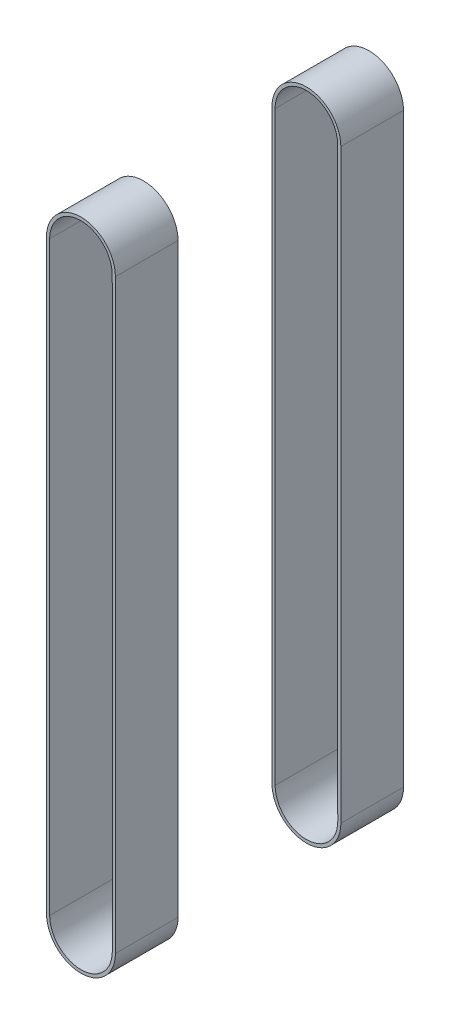
ISO-10303-21;
HEADER;
FILE_DESCRIPTION(('STEP AP214'),'2;1');
FILE_NAME('part.step','',(''),(''),'','','');
FILE_SCHEMA(('AUTOMOTIVE_DESIGN { 1 0 10303 214 1 1 1 1 }'));
ENDSEC;
DATA;
#1=APPLICATION_CONTEXT('core data for automotive mechanical design processes');
#2=APPLICATION_PROTOCOL_DEFINITION('international standard','automotive_design',2000,#1);
#3=PRODUCT_CONTEXT('',#1,'mechanical');
#4=PRODUCT('Part','Part','',(#3));
#5=PRODUCT_RELATED_PRODUCT_CATEGORY('part','',(#4));
#6=PRODUCT_DEFINITION_FORMATION('','',#4);
#7=PRODUCT_DEFINITION_CONTEXT('part definition',#1,'design');
#8=PRODUCT_DEFINITION('design','',#6,#7);
#9=PRODUCT_DEFINITION_SHAPE('','',#8);
#10=(LENGTH_UNIT() NAMED_UNIT(*) SI_UNIT(.MILLI.,.METRE.));
#11=(NAMED_UNIT(*) PLANE_ANGLE_UNIT() SI_UNIT($,.RADIAN.));
#12=(NAMED_UNIT(*) SI_UNIT($,.STERADIAN.) SOLID_ANGLE_UNIT());
#13=UNCERTAINTY_MEASURE_WITH_UNIT(LENGTH_MEASURE(1.E-05),#10,'distance_accuracy_value','');
#14=(GEOMETRIC_REPRESENTATION_CONTEXT(3) GLOBAL_UNCERTAINTY_ASSIGNED_CONTEXT((#13)) GLOBAL_UNIT_ASSIGNED_CONTEXT((#10,
#11,#12)) REPRESENTATION_CONTEXT('',''));
#15=CARTESIAN_POINT('',(0.,0.,0.));
#16=DIRECTION('',(0.,0.,1.));
#17=DIRECTION('',(1.,0.,0.));
#18=AXIS2_PLACEMENT_3D('',#15,#16,#17);
#19=CARTESIAN_POINT('',(291.582674493415,88.0786711003766,-29.21));
#20=DIRECTION('',(0.,0.,-1.));
#21=DIRECTION('',(1.,0.,0.));
#22=AXIS2_PLACEMENT_3D('',#19,#20,#21);
#23=PLANE('',#22);
#24=CARTESIAN_POINT('',(291.582674493415,88.0786711003766,-29.21));
#25=DIRECTION('',(0.,0.,1.));
#26=DIRECTION('',(1.,0.,0.));
#27=AXIS2_PLACEMENT_3D('',#24,#25,#26);
#28=CIRCLE('',#27,6.985);
#29=CARTESIAN_POINT('',(298.567674473504,88.0791985022353,-29.21));
#30=VERTEX_POINT('',#29);
#31=CARTESIAN_POINT('',(284.597674513326,88.0781436985179,-29.21));
#32=VERTEX_POINT('',#31);
#33=EDGE_CURVE('E144',#30,#32,#28,.T.);
#34=ORIENTED_EDGE('',*,*,#33,.F.);
#35=DIRECTION('',(-7.55049189264925E-05,0.999999997149504,0.));
#36=VECTOR('',#35,1.);
#37=CARTESIAN_POINT('',(298.567674473504,88.0791985022353,-29.21));
#38=LINE('',#37,#36);
#39=CARTESIAN_POINT('',(298.576648031743,-30.7681341055025,-29.21));
#40=VERTEX_POINT('',#39);
#41=EDGE_CURVE('E154',#40,#30,#38,.T.);
#42=ORIENTED_EDGE('',*,*,#41,.F.);
#43=CARTESIAN_POINT('',(291.591648051654,-30.7686615073612,-29.21));
#44=DIRECTION('',(0.,0.,1.));
#45=DIRECTION('',(1.,0.,0.));
#46=AXIS2_PLACEMENT_3D('',#43,#44,#45);
#47=CIRCLE('',#46,6.985);
#48=CARTESIAN_POINT('',(284.606648071565,-30.7691889092199,-29.21));
#49=VERTEX_POINT('',#48);
#50=EDGE_CURVE('E151',#49,#40,#47,.T.);
#51=ORIENTED_EDGE('',*,*,#50,.F.);
#52=DIRECTION('',(7.55049189264925E-05,-0.999999997149503,0.));
#53=VECTOR('',#52,1.);
#54=CARTESIAN_POINT('',(284.597674513326,88.0781436985179,-29.21));
#55=LINE('',#54,#53);
#56=EDGE_CURVE('E147',#32,#49,#55,.T.);
#57=ORIENTED_EDGE('',*,*,#56,.F.);
#58=EDGE_LOOP('',(#34,#42,#51,#57));
#59=FACE_BOUND('',#58,.T.);
#60=DIRECTION('',(7.55049189269596E-05,-0.999999997149503,0.));
#61=VECTOR('',#60,1.);
#62=CARTESIAN_POINT('',(285.232674511516,88.0781916441414,-29.21));
#63=LINE('',#62,#61);
#64=CARTESIAN_POINT('',(285.232674511516,88.0781916441414,-29.21));
#65=VERTEX_POINT('',#64);
#66=CARTESIAN_POINT('',(285.241648069755,-30.7691409635964,-29.21));
#67=VERTEX_POINT('',#66);
#68=EDGE_CURVE('E125',#65,#67,#63,.T.);
#69=ORIENTED_EDGE('',*,*,#68,.T.);
#70=CARTESIAN_POINT('',(291.591648051654,-30.7686615073612,-29.21));
#71=DIRECTION('',(0.,0.,1.));
#72=DIRECTION('',(1.,0.,0.));
#73=AXIS2_PLACEMENT_3D('',#70,#71,#72);
#74=CIRCLE('',#73,6.34999999999999);
#75=CARTESIAN_POINT('',(297.941648033553,-30.768182051126,-29.21));
#76=VERTEX_POINT('',#75);
#77=EDGE_CURVE('E130',#67,#76,#74,.T.);
#78=ORIENTED_EDGE('',*,*,#77,.T.);
#79=DIRECTION('',(-7.55049189269596E-05,0.999999997149504,0.));
#80=VECTOR('',#79,1.);
#81=CARTESIAN_POINT('',(297.932674475314,88.0791505566118,-29.21));
#82=LINE('',#81,#80);
#83=CARTESIAN_POINT('',(297.932674475314,88.0791505566118,-29.21));
#84=VERTEX_POINT('',#83);
#85=EDGE_CURVE('E126',#76,#84,#82,.T.);
#86=ORIENTED_EDGE('',*,*,#85,.T.);
#87=CARTESIAN_POINT('',(291.582674493415,88.0786711003766,-29.21));
#88=DIRECTION('',(0.,0.,1.));
#89=DIRECTION('',(1.,0.,0.));
#90=AXIS2_PLACEMENT_3D('',#87,#88,#89);
#91=CIRCLE('',#90,6.34999999999999);
#92=EDGE_CURVE('E111',#84,#65,#91,.T.);
#93=ORIENTED_EDGE('',*,*,#92,.T.);
#94=EDGE_LOOP('',(#69,#78,#86,#93));
#95=FACE_BOUND('',#94,.T.);
#96=ADVANCED_FACE('F45',(#59,#95),#23,.T.);
#97=CARTESIAN_POINT('',(291.582674493415,88.0786711003766,-16.51));
#98=DIRECTION('',(0.,0.,-1.));
#99=DIRECTION('',(1.,0.,0.));
#100=AXIS2_PLACEMENT_3D('',#97,#98,#99);
#101=PLANE('',#100);
#102=CARTESIAN_POINT('',(291.582674493415,88.0786711003766,-16.51));
#103=DIRECTION('',(0.,0.,1.));
#104=DIRECTION('',(1.,0.,0.));
#105=AXIS2_PLACEMENT_3D('',#102,#103,#104);
#106=CIRCLE('',#105,6.985);
#107=CARTESIAN_POINT('',(298.567674473504,88.0791985022353,-16.51));
#108=VERTEX_POINT('',#107);
#109=CARTESIAN_POINT('',(284.597674513326,88.0781436985179,-16.51));
#110=VERTEX_POINT('',#109);
#111=EDGE_CURVE('E119',#108,#110,#106,.T.);
#112=ORIENTED_EDGE('',*,*,#111,.T.);
#113=DIRECTION('',(7.55049189264925E-05,-0.999999997149503,0.));
#114=VECTOR('',#113,1.);
#115=CARTESIAN_POINT('',(284.597674513326,88.0781436985179,-16.51));
#116=LINE('',#115,#114);
#117=CARTESIAN_POINT('',(284.606648071565,-30.7691889092199,-16.51));
#118=VERTEX_POINT('',#117);
#119=EDGE_CURVE('E160',#110,#118,#116,.T.);
#120=ORIENTED_EDGE('',*,*,#119,.T.);
#121=CARTESIAN_POINT('',(291.591648051654,-30.7686615073612,-16.51));
#122=DIRECTION('',(0.,0.,1.));
#123=DIRECTION('',(1.,0.,0.));
#124=AXIS2_PLACEMENT_3D('',#121,#122,#123);
#125=CIRCLE('',#124,6.985);
#126=CARTESIAN_POINT('',(298.576648031743,-30.7681341055025,-16.51));
#127=VERTEX_POINT('',#126);
#128=EDGE_CURVE('E163',#118,#127,#125,.T.);
#129=ORIENTED_EDGE('',*,*,#128,.T.);
#130=DIRECTION('',(-7.55049189264925E-05,0.999999997149504,0.));
#131=VECTOR('',#130,1.);
#132=CARTESIAN_POINT('',(298.567674473504,88.0791985022353,-16.51));
#133=LINE('',#132,#131);
#134=EDGE_CURVE('E148',#127,#108,#133,.T.);
#135=ORIENTED_EDGE('',*,*,#134,.T.);
#136=EDGE_LOOP('',(#112,#120,#129,#135));
#137=FACE_BOUND('',#136,.T.);
#138=CARTESIAN_POINT('',(291.582674493415,88.0786711003766,-16.51));
#139=DIRECTION('',(0.,0.,1.));
#140=DIRECTION('',(1.,0.,0.));
#141=AXIS2_PLACEMENT_3D('',#138,#139,#140);
#142=CIRCLE('',#141,6.34999999999999);
#143=CARTESIAN_POINT('',(297.932674475314,88.0791505566118,-16.51));
#144=VERTEX_POINT('',#143);
#145=CARTESIAN_POINT('',(285.232674511516,88.0781916441414,-16.51));
#146=VERTEX_POINT('',#145);
#147=EDGE_CURVE('E114',#144,#146,#142,.T.);
#148=ORIENTED_EDGE('',*,*,#147,.F.);
#149=DIRECTION('',(-7.55049189269596E-05,0.999999997149504,0.));
#150=VECTOR('',#149,1.);
#151=CARTESIAN_POINT('',(297.932674475314,88.0791505566118,-16.51));
#152=LINE('',#151,#150);
#153=CARTESIAN_POINT('',(297.941648033553,-30.768182051126,-16.51));
#154=VERTEX_POINT('',#153);
#155=EDGE_CURVE('E127',#154,#144,#152,.T.);
#156=ORIENTED_EDGE('',*,*,#155,.F.);
#157=CARTESIAN_POINT('',(291.591648051654,-30.7686615073612,-16.51));
#158=DIRECTION('',(0.,0.,1.));
#159=DIRECTION('',(1.,0.,0.));
#160=AXIS2_PLACEMENT_3D('',#157,#158,#159);
#161=CIRCLE('',#160,6.34999999999999);
#162=CARTESIAN_POINT('',(285.241648069755,-30.7691409635964,-16.51));
#163=VERTEX_POINT('',#162);
#164=EDGE_CURVE('E138',#163,#154,#161,.T.);
#165=ORIENTED_EDGE('',*,*,#164,.F.);
#166=DIRECTION('',(7.55049189269596E-05,-0.999999997149503,0.));
#167=VECTOR('',#166,1.);
#168=CARTESIAN_POINT('',(285.232674511516,88.0781916441414,-16.51));
#169=LINE('',#168,#167);
#170=EDGE_CURVE('E136',#146,#163,#169,.T.);
#171=ORIENTED_EDGE('',*,*,#170,.F.);
#172=EDGE_LOOP('',(#148,#156,#165,#171));
#173=FACE_BOUND('',#172,.T.);
#174=ADVANCED_FACE('F180',(#137,#173),#101,.F.);
#175=CARTESIAN_POINT('',(291.582674493415,88.0786711003766,-29.21));
#176=DIRECTION('',(0.,0.,1.));
#177=DIRECTION('',(-1.,0.,0.));
#178=AXIS2_PLACEMENT_3D('',#175,#176,#177);
#179=CYLINDRICAL_SURFACE('',#178,6.985);
#180=ORIENTED_EDGE('',*,*,#111,.F.);
#181=DIRECTION('',(0.,0.,1.));
#182=VECTOR('',#181,1.);
#183=CARTESIAN_POINT('',(298.567674473504,88.0791985022353,-29.21));
#184=LINE('',#183,#182);
#185=EDGE_CURVE('E157',#30,#108,#184,.T.);
#186=ORIENTED_EDGE('',*,*,#185,.F.);
#187=ORIENTED_EDGE('',*,*,#33,.T.);
#188=DIRECTION('',(0.,0.,1.));
#189=VECTOR('',#188,1.);
#190=CARTESIAN_POINT('',(284.597674513326,88.0781436985179,-29.21));
#191=LINE('',#190,#189);
#192=EDGE_CURVE('E12',#32,#110,#191,.T.);
#193=ORIENTED_EDGE('',*,*,#192,.T.);
#194=EDGE_LOOP('',(#180,#186,#187,#193));
#195=FACE_BOUND('',#194,.T.);
#196=ADVANCED_FACE('F47',(#195),#179,.T.);
#197=CARTESIAN_POINT('',(284.597674513326,88.0781436985179,-29.21));
#198=DIRECTION('',(0.999999997149503,7.55049189264925E-05,0.));
#199=DIRECTION('',(-7.55049189264925E-05,0.999999997149504,0.));
#200=AXIS2_PLACEMENT_3D('',#197,#198,#199);
#201=PLANE('',#200);
#202=ORIENTED_EDGE('',*,*,#119,.F.);
#203=ORIENTED_EDGE('',*,*,#192,.F.);
#204=ORIENTED_EDGE('',*,*,#56,.T.);
#205=DIRECTION('',(0.,0.,1.));
#206=VECTOR('',#205,1.);
#207=CARTESIAN_POINT('',(284.606648071565,-30.7691889092199,-29.21));
#208=LINE('',#207,#206);
#209=EDGE_CURVE('E53',#49,#118,#208,.T.);
#210=ORIENTED_EDGE('',*,*,#209,.T.);
#211=EDGE_LOOP('',(#202,#203,#204,#210));
#212=FACE_BOUND('',#211,.T.);
#213=ADVANCED_FACE('F173',(#212),#201,.F.);
#214=CARTESIAN_POINT('',(291.591648051654,-30.7686615073612,-29.21));
#215=DIRECTION('',(0.,0.,1.));
#216=DIRECTION('',(-1.,0.,0.));
#217=AXIS2_PLACEMENT_3D('',#214,#215,#216);
#218=CYLINDRICAL_SURFACE('',#217,6.985);
#219=ORIENTED_EDGE('',*,*,#128,.F.);
#220=ORIENTED_EDGE('',*,*,#209,.F.);
#221=ORIENTED_EDGE('',*,*,#50,.T.);
#222=DIRECTION('',(0.,0.,1.));
#223=VECTOR('',#222,1.);
#224=CARTESIAN_POINT('',(298.576648031743,-30.7681341055025,-29.21));
#225=LINE('',#224,#223);
#226=EDGE_CURVE('E169',#40,#127,#225,.T.);
#227=ORIENTED_EDGE('',*,*,#226,.T.);
#228=EDGE_LOOP('',(#219,#220,#221,#227));
#229=FACE_BOUND('',#228,.T.);
#230=ADVANCED_FACE('F177',(#229),#218,.T.);
#231=CARTESIAN_POINT('',(298.567674473504,88.0791985022353,-29.21));
#232=DIRECTION('',(-0.999999997149504,-7.55049189264925E-05,0.));
#233=DIRECTION('',(7.55049189264925E-05,-0.999999997149504,0.));
#234=AXIS2_PLACEMENT_3D('',#231,#232,#233);
#235=PLANE('',#234);
#236=ORIENTED_EDGE('',*,*,#134,.F.);
#237=ORIENTED_EDGE('',*,*,#226,.F.);
#238=ORIENTED_EDGE('',*,*,#41,.T.);
#239=ORIENTED_EDGE('',*,*,#185,.T.);
#240=EDGE_LOOP('',(#236,#237,#238,#239));
#241=FACE_BOUND('',#240,.T.);
#242=ADVANCED_FACE('F188',(#241),#235,.F.);
#243=CARTESIAN_POINT('',(291.582674493415,88.0786711003766,-29.21));
#244=DIRECTION('',(0.,0.,1.));
#245=DIRECTION('',(-1.,0.,0.));
#246=AXIS2_PLACEMENT_3D('',#243,#244,#245);
#247=CYLINDRICAL_SURFACE('',#246,6.34999999999999);
#248=ORIENTED_EDGE('',*,*,#147,.T.);
#249=DIRECTION('',(0.,0.,1.));
#250=VECTOR('',#249,1.);
#251=CARTESIAN_POINT('',(285.232674511516,88.0781916441414,-29.21));
#252=LINE('',#251,#250);
#253=EDGE_CURVE('E108',#65,#146,#252,.T.);
#254=ORIENTED_EDGE('',*,*,#253,.F.);
#255=ORIENTED_EDGE('',*,*,#92,.F.);
#256=DIRECTION('',(0.,0.,1.));
#257=VECTOR('',#256,1.);
#258=CARTESIAN_POINT('',(297.932674475314,88.0791505566118,-29.21));
#259=LINE('',#258,#257);
#260=EDGE_CURVE('E68',#84,#144,#259,.T.);
#261=ORIENTED_EDGE('',*,*,#260,.T.);
#262=EDGE_LOOP('',(#248,#254,#255,#261));
#263=FACE_BOUND('',#262,.T.);
#264=ADVANCED_FACE('F110',(#263),#247,.F.);
#265=CARTESIAN_POINT('',(285.232674511516,88.0781916441414,-29.21));
#266=DIRECTION('',(0.999999997149503,7.55049189269596E-05,0.));
#267=DIRECTION('',(-7.55049189269596E-05,0.999999997149504,0.));
#268=AXIS2_PLACEMENT_3D('',#265,#266,#267);
#269=PLANE('',#268);
#270=ORIENTED_EDGE('',*,*,#170,.T.);
#271=DIRECTION('',(0.,0.,1.));
#272=VECTOR('',#271,1.);
#273=CARTESIAN_POINT('',(285.241648069755,-30.7691409635964,-29.21));
#274=LINE('',#273,#272);
#275=EDGE_CURVE('E120',#67,#163,#274,.T.);
#276=ORIENTED_EDGE('',*,*,#275,.F.);
#277=ORIENTED_EDGE('',*,*,#68,.F.);
#278=ORIENTED_EDGE('',*,*,#253,.T.);
#279=EDGE_LOOP('',(#270,#276,#277,#278));
#280=FACE_BOUND('',#279,.T.);
#281=ADVANCED_FACE('F129',(#280),#269,.T.);
#282=CARTESIAN_POINT('',(291.591648051654,-30.7686615073612,-29.21));
#283=DIRECTION('',(0.,0.,1.));
#284=DIRECTION('',(-1.,0.,0.));
#285=AXIS2_PLACEMENT_3D('',#282,#283,#284);
#286=CYLINDRICAL_SURFACE('',#285,6.34999999999999);
#287=ORIENTED_EDGE('',*,*,#164,.T.);
#288=DIRECTION('',(0.,0.,1.));
#289=VECTOR('',#288,1.);
#290=CARTESIAN_POINT('',(297.941648033553,-30.768182051126,-29.21));
#291=LINE('',#290,#289);
#292=EDGE_CURVE('E60',#76,#154,#291,.T.);
#293=ORIENTED_EDGE('',*,*,#292,.F.);
#294=ORIENTED_EDGE('',*,*,#77,.F.);
#295=ORIENTED_EDGE('',*,*,#275,.T.);
#296=EDGE_LOOP('',(#287,#293,#294,#295));
#297=FACE_BOUND('',#296,.T.);
#298=ADVANCED_FACE('F206',(#297),#286,.F.);
#299=CARTESIAN_POINT('',(297.932674475314,88.0791505566118,-29.21));
#300=DIRECTION('',(-0.999999997149504,-7.55049189269596E-05,0.));
#301=DIRECTION('',(7.55049189269596E-05,-0.999999997149504,0.));
#302=AXIS2_PLACEMENT_3D('',#299,#300,#301);
#303=PLANE('',#302);
#304=ORIENTED_EDGE('',*,*,#155,.T.);
#305=ORIENTED_EDGE('',*,*,#260,.F.);
#306=ORIENTED_EDGE('',*,*,#85,.F.);
#307=ORIENTED_EDGE('',*,*,#292,.T.);
#308=EDGE_LOOP('',(#304,#305,#306,#307));
#309=FACE_BOUND('',#308,.T.);
#310=ADVANCED_FACE('F209',(#309),#303,.T.);
#311=CLOSED_SHELL('',(#96,#174,#196,#213,#230,#242,#264,#281,#298,#310));
#312=MANIFOLD_SOLID_BREP('B2',#311);
#313=CARTESIAN_POINT('',(291.582674493415,88.0786711003766,29.21));
#314=DIRECTION('',(0.,0.,1.));
#315=DIRECTION('',(1.,0.,0.));
#316=AXIS2_PLACEMENT_3D('',#313,#314,#315);
#317=PLANE('',#316);
#318=CARTESIAN_POINT('',(291.582674493415,88.0786711003766,29.21));
#319=DIRECTION('',(0.,0.,1.));
#320=DIRECTION('',(1.,0.,0.));
#321=AXIS2_PLACEMENT_3D('',#318,#319,#320);
#322=CIRCLE('',#321,6.985);
#323=CARTESIAN_POINT('',(298.567674473504,88.0791985022353,29.21));
#324=VERTEX_POINT('',#323);
#325=CARTESIAN_POINT('',(284.597674513326,88.0781436985179,29.21));
#326=VERTEX_POINT('',#325);
#327=EDGE_CURVE('E376',#324,#326,#322,.T.);
#328=ORIENTED_EDGE('',*,*,#327,.T.);
#329=DIRECTION('',(7.55049189264925E-05,-0.999999997149503,0.));
#330=VECTOR('',#329,1.);
#331=CARTESIAN_POINT('',(284.597674513326,88.0781436985179,29.21));
#332=LINE('',#331,#330);
#333=CARTESIAN_POINT('',(284.606648071565,-30.7691889092199,29.21));
#334=VERTEX_POINT('',#333);
#335=EDGE_CURVE('E379',#326,#334,#332,.T.);
#336=ORIENTED_EDGE('',*,*,#335,.T.);
#337=CARTESIAN_POINT('',(291.591648051654,-30.7686615073612,29.21));
#338=DIRECTION('',(0.,0.,1.));
#339=DIRECTION('',(1.,0.,0.));
#340=AXIS2_PLACEMENT_3D('',#337,#338,#339);
#341=CIRCLE('',#340,6.985);
#342=CARTESIAN_POINT('',(298.576648031743,-30.7681341055025,29.21));
#343=VERTEX_POINT('',#342);
#344=EDGE_CURVE('E382',#334,#343,#341,.T.);
#345=ORIENTED_EDGE('',*,*,#344,.T.);
#346=DIRECTION('',(-7.55049189264925E-05,0.999999997149504,0.));
#347=VECTOR('',#346,1.);
#348=CARTESIAN_POINT('',(298.567674473504,88.0791985022353,29.21));
#349=LINE('',#348,#347);
#350=EDGE_CURVE('E384',#343,#324,#349,.T.);
#351=ORIENTED_EDGE('',*,*,#350,.T.);
#352=EDGE_LOOP('',(#328,#336,#345,#351));
#353=FACE_BOUND('',#352,.T.);
#354=DIRECTION('',(7.55049189269596E-05,-0.999999997149503,0.));
#355=VECTOR('',#354,1.);
#356=CARTESIAN_POINT('',(285.232674511516,88.0781916441414,29.21));
#357=LINE('',#356,#355);
#358=CARTESIAN_POINT('',(285.232674511516,88.0781916441414,29.21));
#359=VERTEX_POINT('',#358);
#360=CARTESIAN_POINT('',(285.241648069755,-30.7691409635964,29.21));
#361=VERTEX_POINT('',#360);
#362=EDGE_CURVE('E348',#359,#361,#357,.T.);
#363=ORIENTED_EDGE('',*,*,#362,.F.);
#364=CARTESIAN_POINT('',(291.582674493415,88.0786711003766,29.21));
#365=DIRECTION('',(0.,0.,1.));
#366=DIRECTION('',(1.,0.,0.));
#367=AXIS2_PLACEMENT_3D('',#364,#365,#366);
#368=CIRCLE('',#367,6.34999999999999);
#369=CARTESIAN_POINT('',(297.932674475314,88.0791505566118,29.21));
#370=VERTEX_POINT('',#369);
#371=EDGE_CURVE('E340',#370,#359,#368,.T.);
#372=ORIENTED_EDGE('',*,*,#371,.F.);
#373=DIRECTION('',(-7.55049189269596E-05,0.999999997149504,0.));
#374=VECTOR('',#373,1.);
#375=CARTESIAN_POINT('',(297.932674475314,88.0791505566118,29.21));
#376=LINE('',#375,#374);
#377=CARTESIAN_POINT('',(297.941648033553,-30.768182051126,29.21));
#378=VERTEX_POINT('',#377);
#379=EDGE_CURVE('E362',#378,#370,#376,.T.);
#380=ORIENTED_EDGE('',*,*,#379,.F.);
#381=CARTESIAN_POINT('',(291.591648051654,-30.7686615073612,29.21));
#382=DIRECTION('',(0.,0.,1.));
#383=DIRECTION('',(1.,0.,0.));
#384=AXIS2_PLACEMENT_3D('',#381,#382,#383);
#385=CIRCLE('',#384,6.34999999999999);
#386=EDGE_CURVE('E360',#361,#378,#385,.T.);
#387=ORIENTED_EDGE('',*,*,#386,.F.);
#388=EDGE_LOOP('',(#363,#372,#380,#387));
#389=FACE_BOUND('',#388,.T.);
#390=ADVANCED_FACE('F275',(#353,#389),#317,.T.);
#391=CARTESIAN_POINT('',(291.582674493415,88.0786711003766,16.51));
#392=DIRECTION('',(0.,0.,1.));
#393=DIRECTION('',(1.,0.,0.));
#394=AXIS2_PLACEMENT_3D('',#391,#392,#393);
#395=PLANE('',#394);
#396=CARTESIAN_POINT('',(291.582674493415,88.0786711003766,16.51));
#397=DIRECTION('',(0.,0.,1.));
#398=DIRECTION('',(1.,0.,0.));
#399=AXIS2_PLACEMENT_3D('',#396,#397,#398);
#400=CIRCLE('',#399,6.985);
#401=CARTESIAN_POINT('',(298.567674473504,88.0791985022353,16.51));
#402=VERTEX_POINT('',#401);
#403=CARTESIAN_POINT('',(284.597674513326,88.0781436985179,16.51));
#404=VERTEX_POINT('',#403);
#405=EDGE_CURVE('E356',#402,#404,#400,.T.);
#406=ORIENTED_EDGE('',*,*,#405,.F.);
#407=DIRECTION('',(-7.55049189264925E-05,0.999999997149504,0.));
#408=VECTOR('',#407,1.);
#409=CARTESIAN_POINT('',(298.567674473504,88.0791985022353,16.51));
#410=LINE('',#409,#408);
#411=CARTESIAN_POINT('',(298.576648031743,-30.7681341055025,16.51));
#412=VERTEX_POINT('',#411);
#413=EDGE_CURVE('E380',#412,#402,#410,.T.);
#414=ORIENTED_EDGE('',*,*,#413,.F.);
#415=CARTESIAN_POINT('',(291.591648051654,-30.7686615073612,16.51));
#416=DIRECTION('',(0.,0.,1.));
#417=DIRECTION('',(1.,0.,0.));
#418=AXIS2_PLACEMENT_3D('',#415,#416,#417);
#419=CIRCLE('',#418,6.985);
#420=CARTESIAN_POINT('',(284.606648071565,-30.7691889092199,16.51));
#421=VERTEX_POINT('',#420);
#422=EDGE_CURVE('E391',#421,#412,#419,.T.);
#423=ORIENTED_EDGE('',*,*,#422,.F.);
#424=DIRECTION('',(7.55049189264925E-05,-0.999999997149503,0.));
#425=VECTOR('',#424,1.);
#426=CARTESIAN_POINT('',(284.597674513326,88.0781436985179,16.51));
#427=LINE('',#426,#425);
#428=EDGE_CURVE('E389',#404,#421,#427,.T.);
#429=ORIENTED_EDGE('',*,*,#428,.F.);
#430=EDGE_LOOP('',(#406,#414,#423,#429));
#431=FACE_BOUND('',#430,.T.);
#432=CARTESIAN_POINT('',(291.582674493415,88.0786711003766,16.51));
#433=DIRECTION('',(0.,0.,1.));
#434=DIRECTION('',(1.,0.,0.));
#435=AXIS2_PLACEMENT_3D('',#432,#433,#434);
#436=CIRCLE('',#435,6.34999999999999);
#437=CARTESIAN_POINT('',(297.932674475314,88.0791505566118,16.51));
#438=VERTEX_POINT('',#437);
#439=CARTESIAN_POINT('',(285.232674511516,88.0781916441414,16.51));
#440=VERTEX_POINT('',#439);
#441=EDGE_CURVE('E298',#438,#440,#436,.T.);
#442=ORIENTED_EDGE('',*,*,#441,.T.);
#443=DIRECTION('',(7.55049189269596E-05,-0.999999997149503,0.));
#444=VECTOR('',#443,1.);
#445=CARTESIAN_POINT('',(285.232674511516,88.0781916441414,16.51));
#446=LINE('',#445,#444);
#447=CARTESIAN_POINT('',(285.241648069755,-30.7691409635964,16.51));
#448=VERTEX_POINT('',#447);
#449=EDGE_CURVE('E355',#440,#448,#446,.T.);
#450=ORIENTED_EDGE('',*,*,#449,.T.);
#451=CARTESIAN_POINT('',(291.591648051654,-30.7686615073612,16.51));
#452=DIRECTION('',(0.,0.,1.));
#453=DIRECTION('',(1.,0.,0.));
#454=AXIS2_PLACEMENT_3D('',#451,#452,#453);
#455=CIRCLE('',#454,6.34999999999999);
#456=CARTESIAN_POINT('',(297.941648033553,-30.768182051126,16.51));
#457=VERTEX_POINT('',#456);
#458=EDGE_CURVE('E368',#448,#457,#455,.T.);
#459=ORIENTED_EDGE('',*,*,#458,.T.);
#460=DIRECTION('',(-7.55049189269596E-05,0.999999997149504,0.));
#461=VECTOR('',#460,1.);
#462=CARTESIAN_POINT('',(297.932674475314,88.0791505566118,16.51));
#463=LINE('',#462,#461);
#464=EDGE_CURVE('E349',#457,#438,#463,.T.);
#465=ORIENTED_EDGE('',*,*,#464,.T.);
#466=EDGE_LOOP('',(#442,#450,#459,#465));
#467=FACE_BOUND('',#466,.T.);
#468=ADVANCED_FACE('F409',(#431,#467),#395,.F.);
#469=CARTESIAN_POINT('',(291.582674493415,88.0786711003766,29.21));
#470=DIRECTION('',(0.,0.,-1.));
#471=DIRECTION('',(-1.,0.,0.));
#472=AXIS2_PLACEMENT_3D('',#469,#470,#471);
#473=CYLINDRICAL_SURFACE('',#472,6.985);
#474=ORIENTED_EDGE('',*,*,#405,.T.);
#475=DIRECTION('',(0.,0.,-1.));
#476=VECTOR('',#475,1.);
#477=CARTESIAN_POINT('',(284.597674513326,88.0781436985179,29.21));
#478=LINE('',#477,#476);
#479=EDGE_CURVE('E43',#326,#404,#478,.T.);
#480=ORIENTED_EDGE('',*,*,#479,.F.);
#481=ORIENTED_EDGE('',*,*,#327,.F.);
#482=DIRECTION('',(0.,0.,-1.));
#483=VECTOR('',#482,1.);
#484=CARTESIAN_POINT('',(298.567674473504,88.0791985022353,29.21));
#485=LINE('',#484,#483);
#486=EDGE_CURVE('E386',#324,#402,#485,.T.);
#487=ORIENTED_EDGE('',*,*,#486,.T.);
#488=EDGE_LOOP('',(#474,#480,#481,#487));
#489=FACE_BOUND('',#488,.T.);
#490=ADVANCED_FACE('F277',(#489),#473,.T.);
#491=CARTESIAN_POINT('',(284.597674513326,88.0781436985179,29.21));
#492=DIRECTION('',(0.999999997149503,7.55049189264925E-05,0.));
#493=DIRECTION('',(-7.55049189264925E-05,0.999999997149504,0.));
#494=AXIS2_PLACEMENT_3D('',#491,#492,#493);
#495=PLANE('',#494);
#496=ORIENTED_EDGE('',*,*,#428,.T.);
#497=DIRECTION('',(0.,0.,-1.));
#498=VECTOR('',#497,1.);
#499=CARTESIAN_POINT('',(284.606648071565,-30.7691889092199,29.21));
#500=LINE('',#499,#498);
#501=EDGE_CURVE('E283',#334,#421,#500,.T.);
#502=ORIENTED_EDGE('',*,*,#501,.F.);
#503=ORIENTED_EDGE('',*,*,#335,.F.);
#504=ORIENTED_EDGE('',*,*,#479,.T.);
#505=EDGE_LOOP('',(#496,#502,#503,#504));
#506=FACE_BOUND('',#505,.T.);
#507=ADVANCED_FACE('F419',(#506),#495,.F.);
#508=CARTESIAN_POINT('',(291.591648051654,-30.7686615073612,29.21));
#509=DIRECTION('',(0.,0.,-1.));
#510=DIRECTION('',(-1.,0.,0.));
#511=AXIS2_PLACEMENT_3D('',#508,#509,#510);
#512=CYLINDRICAL_SURFACE('',#511,6.985);
#513=ORIENTED_EDGE('',*,*,#422,.T.);
#514=DIRECTION('',(0.,0.,-1.));
#515=VECTOR('',#514,1.);
#516=CARTESIAN_POINT('',(298.576648031743,-30.7681341055025,29.21));
#517=LINE('',#516,#515);
#518=EDGE_CURVE('E396',#343,#412,#517,.T.);
#519=ORIENTED_EDGE('',*,*,#518,.F.);
#520=ORIENTED_EDGE('',*,*,#344,.F.);
#521=ORIENTED_EDGE('',*,*,#501,.T.);
#522=EDGE_LOOP('',(#513,#519,#520,#521));
#523=FACE_BOUND('',#522,.T.);
#524=ADVANCED_FACE('F403',(#523),#512,.T.);
#525=CARTESIAN_POINT('',(298.567674473504,88.0791985022353,29.21));
#526=DIRECTION('',(-0.999999997149504,-7.55049189264925E-05,0.));
#527=DIRECTION('',(7.55049189264925E-05,-0.999999997149504,0.));
#528=AXIS2_PLACEMENT_3D('',#525,#526,#527);
#529=PLANE('',#528);
#530=ORIENTED_EDGE('',*,*,#413,.T.);
#531=ORIENTED_EDGE('',*,*,#486,.F.);
#532=ORIENTED_EDGE('',*,*,#350,.F.);
#533=ORIENTED_EDGE('',*,*,#518,.T.);
#534=EDGE_LOOP('',(#530,#531,#532,#533));
#535=FACE_BOUND('',#534,.T.);
#536=ADVANCED_FACE('F413',(#535),#529,.F.);
#537=CARTESIAN_POINT('',(291.582674493415,88.0786711003766,29.21));
#538=DIRECTION('',(0.,0.,-1.));
#539=DIRECTION('',(-1.,0.,0.));
#540=AXIS2_PLACEMENT_3D('',#537,#538,#539);
#541=CYLINDRICAL_SURFACE('',#540,6.34999999999999);
#542=ORIENTED_EDGE('',*,*,#441,.F.);
#543=DIRECTION('',(0.,0.,-1.));
#544=VECTOR('',#543,1.);
#545=CARTESIAN_POINT('',(297.932674475314,88.0791505566118,29.21));
#546=LINE('',#545,#544);
#547=EDGE_CURVE('E344',#370,#438,#546,.T.);
#548=ORIENTED_EDGE('',*,*,#547,.F.);
#549=ORIENTED_EDGE('',*,*,#371,.T.);
#550=DIRECTION('',(0.,0.,-1.));
#551=VECTOR('',#550,1.);
#552=CARTESIAN_POINT('',(285.232674511516,88.0781916441414,29.21));
#553=LINE('',#552,#551);
#554=EDGE_CURVE('E343',#359,#440,#553,.T.);
#555=ORIENTED_EDGE('',*,*,#554,.T.);
#556=EDGE_LOOP('',(#542,#548,#549,#555));
#557=FACE_BOUND('',#556,.T.);
#558=ADVANCED_FACE('F342',(#557),#541,.F.);
#559=CARTESIAN_POINT('',(285.232674511516,88.0781916441414,29.21));
#560=DIRECTION('',(0.999999997149503,7.55049189269596E-05,0.));
#561=DIRECTION('',(-7.55049189269596E-05,0.999999997149504,0.));
#562=AXIS2_PLACEMENT_3D('',#559,#560,#561);
#563=PLANE('',#562);
#564=ORIENTED_EDGE('',*,*,#449,.F.);
#565=ORIENTED_EDGE('',*,*,#554,.F.);
#566=ORIENTED_EDGE('',*,*,#362,.T.);
#567=DIRECTION('',(0.,0.,-1.));
#568=VECTOR('',#567,1.);
#569=CARTESIAN_POINT('',(285.241648069755,-30.7691409635964,29.21));
#570=LINE('',#569,#568);
#571=EDGE_CURVE('E357',#361,#448,#570,.T.);
#572=ORIENTED_EDGE('',*,*,#571,.T.);
#573=EDGE_LOOP('',(#564,#565,#566,#572));
#574=FACE_BOUND('',#573,.T.);
#575=ADVANCED_FACE('F352',(#574),#563,.T.);
#576=CARTESIAN_POINT('',(291.591648051654,-30.7686615073612,29.21));
#577=DIRECTION('',(0.,0.,-1.));
#578=DIRECTION('',(-1.,0.,0.));
#579=AXIS2_PLACEMENT_3D('',#576,#577,#578);
#580=CYLINDRICAL_SURFACE('',#579,6.34999999999999);
#581=ORIENTED_EDGE('',*,*,#458,.F.);
#582=ORIENTED_EDGE('',*,*,#571,.F.);
#583=ORIENTED_EDGE('',*,*,#386,.T.);
#584=DIRECTION('',(0.,0.,-1.));
#585=VECTOR('',#584,1.);
#586=CARTESIAN_POINT('',(297.941648033553,-30.768182051126,29.21));
#587=LINE('',#586,#585);
#588=EDGE_CURVE('E290',#378,#457,#587,.T.);
#589=ORIENTED_EDGE('',*,*,#588,.T.);
#590=EDGE_LOOP('',(#581,#582,#583,#589));
#591=FACE_BOUND('',#590,.T.);
#592=ADVANCED_FACE('F442',(#591),#580,.F.);
#593=CARTESIAN_POINT('',(297.932674475314,88.0791505566118,29.21));
#594=DIRECTION('',(-0.999999997149504,-7.55049189269596E-05,0.));
#595=DIRECTION('',(7.55049189269596E-05,-0.999999997149504,0.));
#596=AXIS2_PLACEMENT_3D('',#593,#594,#595);
#597=PLANE('',#596);
#598=ORIENTED_EDGE('',*,*,#464,.F.);
#599=ORIENTED_EDGE('',*,*,#588,.F.);
#600=ORIENTED_EDGE('',*,*,#379,.T.);
#601=ORIENTED_EDGE('',*,*,#547,.T.);
#602=EDGE_LOOP('',(#598,#599,#600,#601));
#603=FACE_BOUND('',#602,.T.);
#604=ADVANCED_FACE('F446',(#603),#597,.T.);
#605=CLOSED_SHELL('',(#390,#468,#490,#507,#524,#536,#558,#575,#592,#604));
#606=MANIFOLD_SOLID_BREP('B6',#605);
#607=ADVANCED_BREP_SHAPE_REPRESENTATION('',(#18,#312,#606),#14);
#608=SHAPE_DEFINITION_REPRESENTATION(#9,#607);
ENDSEC;
END-ISO-10303-21;
